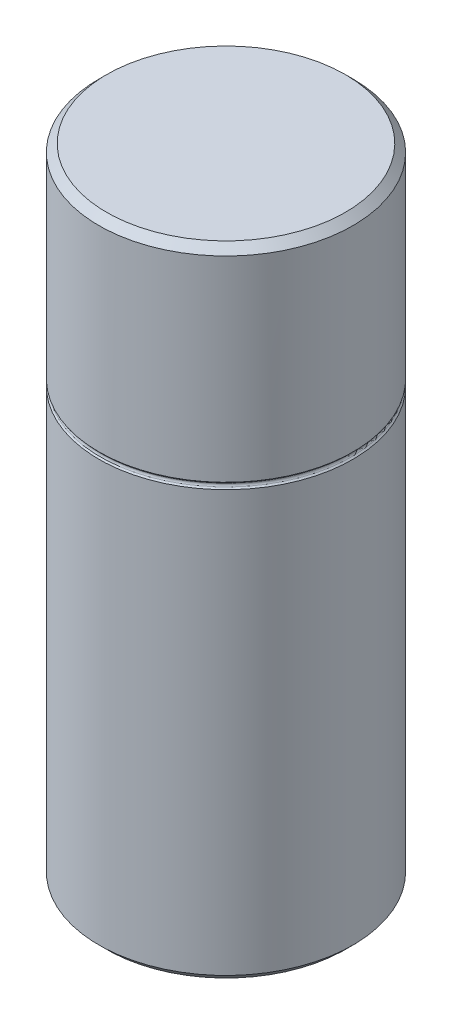
ISO-10303-21;
HEADER;
FILE_DESCRIPTION(('STEP AP214'),'2;1');
FILE_NAME('part.step','',(''),(''),'','','');
FILE_SCHEMA(('AUTOMOTIVE_DESIGN { 1 0 10303 214 1 1 1 1 }'));
ENDSEC;
DATA;
#1=APPLICATION_CONTEXT('core data for automotive mechanical design processes');
#2=APPLICATION_PROTOCOL_DEFINITION('international standard','automotive_design',2000,#1);
#3=PRODUCT_CONTEXT('',#1,'mechanical');
#4=PRODUCT('Part','Part','',(#3));
#5=PRODUCT_RELATED_PRODUCT_CATEGORY('part','',(#4));
#6=PRODUCT_DEFINITION_FORMATION('','',#4);
#7=PRODUCT_DEFINITION_CONTEXT('part definition',#1,'design');
#8=PRODUCT_DEFINITION('design','',#6,#7);
#9=PRODUCT_DEFINITION_SHAPE('','',#8);
#10=(LENGTH_UNIT() NAMED_UNIT(*) SI_UNIT(.MILLI.,.METRE.));
#11=(NAMED_UNIT(*) PLANE_ANGLE_UNIT() SI_UNIT($,.RADIAN.));
#12=(NAMED_UNIT(*) SI_UNIT($,.STERADIAN.) SOLID_ANGLE_UNIT());
#13=UNCERTAINTY_MEASURE_WITH_UNIT(LENGTH_MEASURE(1.E-05),#10,'distance_accuracy_value','');
#14=(GEOMETRIC_REPRESENTATION_CONTEXT(3) GLOBAL_UNCERTAINTY_ASSIGNED_CONTEXT((#13)) GLOBAL_UNIT_ASSIGNED_CONTEXT((#10,
#11,#12)) REPRESENTATION_CONTEXT('',''));
#15=CARTESIAN_POINT('',(0.,0.,0.));
#16=DIRECTION('',(0.,0.,1.));
#17=DIRECTION('',(1.,0.,0.));
#18=AXIS2_PLACEMENT_3D('',#15,#16,#17);
#19=CARTESIAN_POINT('',(0.,0.,0.));
#20=DIRECTION('',(0.,-1.,0.));
#21=DIRECTION('',(0.,0.,-1.));
#22=AXIS2_PLACEMENT_3D('',#19,#20,#21);
#23=CYLINDRICAL_SURFACE('',#22,6.3881);
#24=CARTESIAN_POINT('',(0.,0.,0.));
#25=DIRECTION('',(0.,-1.,0.));
#26=DIRECTION('',(0.,0.,-1.));
#27=AXIS2_PLACEMENT_3D('',#24,#25,#26);
#28=CIRCLE('',#27,6.3881);
#29=CARTESIAN_POINT('',(0.,0.,-6.3881));
#30=VERTEX_POINT('',#29);
#31=EDGE_CURVE('E10',#30,#30,#28,.T.);
#32=ORIENTED_EDGE('',*,*,#31,.T.);
#33=EDGE_LOOP('',(#32));
#34=FACE_BOUND('',#33,.T.);
#35=CARTESIAN_POINT('',(0.,4.572,0.));
#36=DIRECTION('',(0.,-1.,0.));
#37=DIRECTION('',(0.,0.,-1.));
#38=AXIS2_PLACEMENT_3D('',#35,#36,#37);
#39=CIRCLE('',#38,6.3881);
#40=CARTESIAN_POINT('',(0.,4.572,-6.3881));
#41=VERTEX_POINT('',#40);
#42=EDGE_CURVE('E51',#41,#41,#39,.T.);
#43=ORIENTED_EDGE('',*,*,#42,.F.);
#44=EDGE_LOOP('',(#43));
#45=FACE_BOUND('',#44,.T.);
#46=ADVANCED_FACE('F30',(#34,#45),#23,.F.);
#47=CARTESIAN_POINT('',(11.8745,0.,0.));
#48=DIRECTION('',(0.,-1.,0.));
#49=DIRECTION('',(0.,0.,-1.));
#50=AXIS2_PLACEMENT_3D('',#47,#48,#49);
#51=PLANE('',#50);
#52=CARTESIAN_POINT('',(0.,0.,0.));
#53=DIRECTION('',(0.,-1.,0.));
#54=DIRECTION('',(0.,0.,-1.));
#55=AXIS2_PLACEMENT_3D('',#52,#53,#54);
#56=CIRCLE('',#55,11.8745);
#57=CARTESIAN_POINT('',(0.,0.,-11.8745));
#58=VERTEX_POINT('',#57);
#59=EDGE_CURVE('E37',#58,#58,#56,.T.);
#60=ORIENTED_EDGE('',*,*,#59,.T.);
#61=EDGE_LOOP('',(#60));
#62=FACE_BOUND('',#61,.T.);
#63=ORIENTED_EDGE('',*,*,#31,.F.);
#64=EDGE_LOOP('',(#63));
#65=FACE_BOUND('',#64,.T.);
#66=ADVANCED_FACE('F89',(#62,#65),#51,.T.);
#67=CARTESIAN_POINT('',(0.,0.,0.));
#68=DIRECTION('',(0.,1.,0.));
#69=DIRECTION('',(0.,0.,1.));
#70=AXIS2_PLACEMENT_3D('',#67,#68,#69);
#71=CONICAL_SURFACE('',#70,11.8745,0.785398163397449);
#72=CARTESIAN_POINT('',(0.,0.762,0.));
#73=DIRECTION('',(0.,-1.,0.));
#74=DIRECTION('',(0.,0.,-1.));
#75=AXIS2_PLACEMENT_3D('',#72,#73,#74);
#76=CIRCLE('',#75,12.6365);
#77=CARTESIAN_POINT('',(0.,0.762,-12.6365));
#78=VERTEX_POINT('',#77);
#79=EDGE_CURVE('E42',#78,#78,#76,.T.);
#80=ORIENTED_EDGE('',*,*,#79,.T.);
#81=EDGE_LOOP('',(#80));
#82=FACE_BOUND('',#81,.T.);
#83=ORIENTED_EDGE('',*,*,#59,.F.);
#84=EDGE_LOOP('',(#83));
#85=FACE_BOUND('',#84,.T.);
#86=ADVANCED_FACE('F73',(#82,#85),#71,.T.);
#87=CARTESIAN_POINT('',(0.,0.,0.));
#88=DIRECTION('',(0.,-1.,0.));
#89=DIRECTION('',(0.,0.,-1.));
#90=AXIS2_PLACEMENT_3D('',#87,#88,#89);
#91=CYLINDRICAL_SURFACE('',#90,12.6365);
#92=CARTESIAN_POINT('',(0.,42.6085,0.));
#93=DIRECTION('',(0.,-1.,0.));
#94=DIRECTION('',(0.,0.,-1.));
#95=AXIS2_PLACEMENT_3D('',#92,#93,#94);
#96=CIRCLE('',#95,12.6365);
#97=CARTESIAN_POINT('',(0.,42.6085,-12.6365));
#98=VERTEX_POINT('',#97);
#99=EDGE_CURVE('E45',#98,#98,#96,.F.);
#100=ORIENTED_EDGE('',*,*,#99,.F.);
#101=EDGE_LOOP('',(#100));
#102=FACE_BOUND('',#101,.T.);
#103=ORIENTED_EDGE('',*,*,#79,.F.);
#104=EDGE_LOOP('',(#103));
#105=FACE_BOUND('',#104,.T.);
#106=ADVANCED_FACE('F76',(#102,#105),#91,.T.);
#107=CARTESIAN_POINT('',(6.1341,4.826,0.));
#108=DIRECTION('',(0.,-1.,0.));
#109=DIRECTION('',(0.,0.,-1.));
#110=AXIS2_PLACEMENT_3D('',#107,#108,#109);
#111=PLANE('',#110);
#112=CARTESIAN_POINT('',(0.,4.826,0.));
#113=DIRECTION('',(0.,-1.,0.));
#114=DIRECTION('',(0.,0.,-1.));
#115=AXIS2_PLACEMENT_3D('',#112,#113,#114);
#116=CIRCLE('',#115,6.1341);
#117=CARTESIAN_POINT('',(0.,4.826,-6.1341));
#118=VERTEX_POINT('',#117);
#119=EDGE_CURVE('E62',#118,#118,#116,.T.);
#120=ORIENTED_EDGE('',*,*,#119,.T.);
#121=EDGE_LOOP('',(#120));
#122=FACE_BOUND('',#121,.T.);
#123=ADVANCED_FACE('F78',(#122),#111,.T.);
#124=CARTESIAN_POINT('',(0.,4.826,0.));
#125=DIRECTION('',(0.,-1.,0.));
#126=DIRECTION('',(0.,0.,-1.));
#127=AXIS2_PLACEMENT_3D('',#124,#125,#126);
#128=CONICAL_SURFACE('',#127,6.1341,0.785398163397448);
#129=ORIENTED_EDGE('',*,*,#42,.T.);
#130=EDGE_LOOP('',(#129));
#131=FACE_BOUND('',#130,.T.);
#132=ORIENTED_EDGE('',*,*,#119,.F.);
#133=EDGE_LOOP('',(#132));
#134=FACE_BOUND('',#133,.T.);
#135=ADVANCED_FACE('F86',(#131,#134),#128,.F.);
#136=CARTESIAN_POINT('',(0.,43.307,0.));
#137=DIRECTION('',(0.,1.,0.));
#138=DIRECTION('',(0.,0.,1.));
#139=AXIS2_PLACEMENT_3D('',#136,#137,#138);
#140=CONICAL_SURFACE('',#139,12.7,0.785398163397448);
#141=CARTESIAN_POINT('',(0.,43.2435,0.));
#142=DIRECTION('',(0.,1.,0.));
#143=DIRECTION('',(0.,0.,1.));
#144=AXIS2_PLACEMENT_3D('',#141,#142,#143);
#145=CIRCLE('',#144,12.6365);
#146=CARTESIAN_POINT('',(0.,43.2435,12.6365));
#147=VERTEX_POINT('',#146);
#148=EDGE_CURVE('E33',#147,#147,#145,.F.);
#149=ORIENTED_EDGE('',*,*,#148,.T.);
#150=EDGE_LOOP('',(#149));
#151=FACE_BOUND('',#150,.T.);
#152=CARTESIAN_POINT('',(0.,43.1056051224214,0.));
#153=DIRECTION('',(0.,-1.,0.));
#154=DIRECTION('',(0.,0.,-1.));
#155=AXIS2_PLACEMENT_3D('',#152,#153,#154);
#156=CIRCLE('',#155,12.4986051224214);
#157=CARTESIAN_POINT('',(0.,43.1056051224214,-12.4986051224214));
#158=VERTEX_POINT('',#157);
#159=EDGE_CURVE('E53',#158,#158,#156,.T.);
#160=ORIENTED_EDGE('',*,*,#159,.F.);
#161=EDGE_LOOP('',(#160));
#162=FACE_BOUND('',#161,.T.);
#163=ADVANCED_FACE('F105',(#151,#162),#140,.T.);
#164=CARTESIAN_POINT('',(0.,42.7463948775786,0.));
#165=DIRECTION('',(0.,-1.,0.));
#166=DIRECTION('',(0.,0.,-1.));
#167=AXIS2_PLACEMENT_3D('',#164,#165,#166);
#168=CONICAL_SURFACE('',#167,12.4986051224214,0.785398163397448);
#169=ORIENTED_EDGE('',*,*,#99,.T.);
#170=EDGE_LOOP('',(#169));
#171=FACE_BOUND('',#170,.T.);
#172=CARTESIAN_POINT('',(0.,42.7463948775786,0.));
#173=DIRECTION('',(0.,-1.,0.));
#174=DIRECTION('',(0.,0.,-1.));
#175=AXIS2_PLACEMENT_3D('',#172,#173,#174);
#176=CIRCLE('',#175,12.4986051224214);
#177=CARTESIAN_POINT('',(0.,42.7463948775786,-12.4986051224214));
#178=VERTEX_POINT('',#177);
#179=EDGE_CURVE('E47',#178,#178,#176,.T.);
#180=ORIENTED_EDGE('',*,*,#179,.T.);
#181=EDGE_LOOP('',(#180));
#182=FACE_BOUND('',#181,.T.);
#183=ADVANCED_FACE('F111',(#171,#182),#168,.T.);
#184=CARTESIAN_POINT('',(0.,42.926,0.));
#185=DIRECTION('',(0.,-1.,0.));
#186=DIRECTION('',(0.,0.,-1.));
#187=AXIS2_PLACEMENT_3D('',#184,#185,#186);
#188=TOROIDAL_SURFACE('',#187,12.6782102448428,0.254);
#189=ORIENTED_EDGE('',*,*,#179,.F.);
#190=EDGE_LOOP('',(#189));
#191=FACE_BOUND('',#190,.T.);
#192=ORIENTED_EDGE('',*,*,#159,.T.);
#193=EDGE_LOOP('',(#192));
#194=FACE_BOUND('',#193,.T.);
#195=ADVANCED_FACE('F118',(#191,#194),#188,.F.);
#196=CARTESIAN_POINT('',(11.8745,63.5,0.));
#197=DIRECTION('',(0.,1.,0.));
#198=DIRECTION('',(0.,0.,1.));
#199=AXIS2_PLACEMENT_3D('',#196,#197,#198);
#200=PLANE('',#199);
#201=CARTESIAN_POINT('',(0.,63.5,0.));
#202=DIRECTION('',(0.,-1.,0.));
#203=DIRECTION('',(0.,0.,-1.));
#204=AXIS2_PLACEMENT_3D('',#201,#202,#203);
#205=CIRCLE('',#204,11.8745);
#206=CARTESIAN_POINT('',(0.,63.5,-11.8745));
#207=VERTEX_POINT('',#206);
#208=EDGE_CURVE('E65',#207,#207,#205,.T.);
#209=ORIENTED_EDGE('',*,*,#208,.F.);
#210=EDGE_LOOP('',(#209));
#211=FACE_BOUND('',#210,.T.);
#212=ADVANCED_FACE('F116',(#211),#200,.T.);
#213=CARTESIAN_POINT('',(0.,62.738,0.));
#214=DIRECTION('',(0.,-1.,0.));
#215=DIRECTION('',(0.,0.,-1.));
#216=AXIS2_PLACEMENT_3D('',#213,#214,#215);
#217=CONICAL_SURFACE('',#216,12.6365,0.78539816339745);
#218=ORIENTED_EDGE('',*,*,#208,.T.);
#219=EDGE_LOOP('',(#218));
#220=FACE_BOUND('',#219,.T.);
#221=CARTESIAN_POINT('',(0.,62.738,0.));
#222=DIRECTION('',(0.,-1.,0.));
#223=DIRECTION('',(0.,0.,-1.));
#224=AXIS2_PLACEMENT_3D('',#221,#222,#223);
#225=CIRCLE('',#224,12.6365);
#226=CARTESIAN_POINT('',(0.,62.738,-12.6365));
#227=VERTEX_POINT('',#226);
#228=EDGE_CURVE('E68',#227,#227,#225,.T.);
#229=ORIENTED_EDGE('',*,*,#228,.F.);
#230=EDGE_LOOP('',(#229));
#231=FACE_BOUND('',#230,.T.);
#232=ADVANCED_FACE('F93',(#220,#231),#217,.T.);
#233=ORIENTED_EDGE('',*,*,#148,.F.);
#234=EDGE_LOOP('',(#233));
#235=FACE_BOUND('',#234,.T.);
#236=ORIENTED_EDGE('',*,*,#228,.T.);
#237=EDGE_LOOP('',(#236));
#238=FACE_BOUND('',#237,.T.);
#239=ADVANCED_FACE('F81',(#235,#238),#91,.T.);
#240=CLOSED_SHELL('',(#46,#66,#86,#106,#123,#135,#163,#183,#195,#212,#232,#239));
#241=MANIFOLD_SOLID_BREP('B2',#240);
#242=ADVANCED_BREP_SHAPE_REPRESENTATION('',(#18,#241),#14);
#243=SHAPE_DEFINITION_REPRESENTATION(#9,#242);
ENDSEC;
END-ISO-10303-21;
